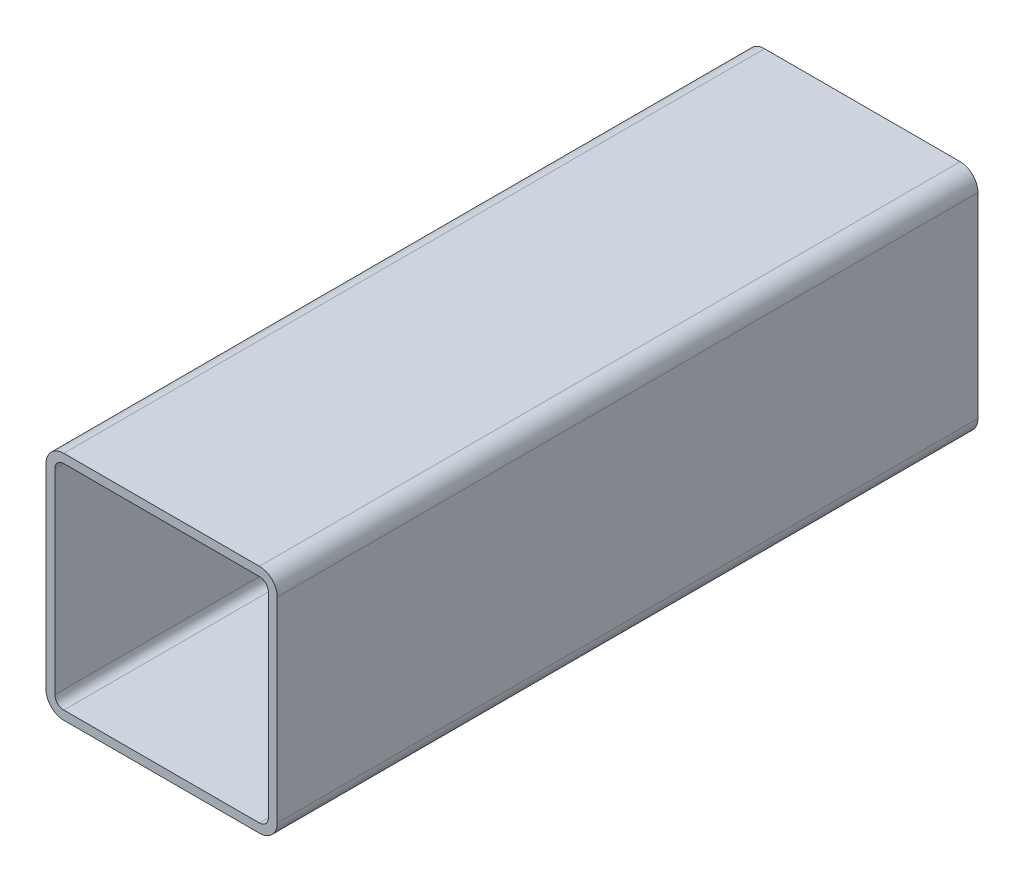
ISO-10303-21;
HEADER;
FILE_DESCRIPTION(('STEP AP214'),'2;1');
FILE_NAME('part.step','',(''),(''),'','','');
FILE_SCHEMA(('AUTOMOTIVE_DESIGN { 1 0 10303 214 1 1 1 1 }'));
ENDSEC;
DATA;
#1=APPLICATION_CONTEXT('core data for automotive mechanical design processes');
#2=APPLICATION_PROTOCOL_DEFINITION('international standard','automotive_design',2000,#1);
#3=PRODUCT_CONTEXT('',#1,'mechanical');
#4=PRODUCT('Part','Part','',(#3));
#5=PRODUCT_RELATED_PRODUCT_CATEGORY('part','',(#4));
#6=PRODUCT_DEFINITION_FORMATION('','',#4);
#7=PRODUCT_DEFINITION_CONTEXT('part definition',#1,'design');
#8=PRODUCT_DEFINITION('design','',#6,#7);
#9=PRODUCT_DEFINITION_SHAPE('','',#8);
#10=(LENGTH_UNIT() NAMED_UNIT(*) SI_UNIT(.MILLI.,.METRE.));
#11=(NAMED_UNIT(*) PLANE_ANGLE_UNIT() SI_UNIT($,.RADIAN.));
#12=(NAMED_UNIT(*) SI_UNIT($,.STERADIAN.) SOLID_ANGLE_UNIT());
#13=UNCERTAINTY_MEASURE_WITH_UNIT(LENGTH_MEASURE(1.E-05),#10,'distance_accuracy_value','');
#14=(GEOMETRIC_REPRESENTATION_CONTEXT(3) GLOBAL_UNCERTAINTY_ASSIGNED_CONTEXT((#13)) GLOBAL_UNIT_ASSIGNED_CONTEXT((#10,
#11,#12)) REPRESENTATION_CONTEXT('',''));
#15=CARTESIAN_POINT('',(0.,0.,0.));
#16=DIRECTION('',(0.,0.,1.));
#17=DIRECTION('',(1.,0.,0.));
#18=AXIS2_PLACEMENT_3D('',#15,#16,#17);
#19=CARTESIAN_POINT('',(-2.792,2.792,10.));
#20=DIRECTION('',(0.,0.,1.));
#21=DIRECTION('',(1.,0.,0.));
#22=AXIS2_PLACEMENT_3D('',#19,#20,#21);
#23=PLANE('',#22);
#24=CARTESIAN_POINT('',(-2.792,2.792,10.));
#25=DIRECTION('',(0.,0.,1.));
#26=DIRECTION('',(-1.,0.,0.));
#27=AXIS2_PLACEMENT_3D('',#24,#25,#26);
#28=CIRCLE('',#27,0.508);
#29=CARTESIAN_POINT('',(-2.792,3.3,10.));
#30=VERTEX_POINT('',#29);
#31=CARTESIAN_POINT('',(-3.3,2.792,10.));
#32=VERTEX_POINT('',#31);
#33=EDGE_CURVE('E259',#30,#32,#28,.T.);
#34=ORIENTED_EDGE('',*,*,#33,.T.);
#35=DIRECTION('',(0.,-1.,0.));
#36=VECTOR('',#35,1.);
#37=CARTESIAN_POINT('',(-3.3,-2.792,10.));
#38=LINE('',#37,#36);
#39=CARTESIAN_POINT('',(-3.3,-2.792,10.));
#40=VERTEX_POINT('',#39);
#41=EDGE_CURVE('E262',#32,#40,#38,.T.);
#42=ORIENTED_EDGE('',*,*,#41,.T.);
#43=CARTESIAN_POINT('',(-2.792,-2.792,10.));
#44=DIRECTION('',(0.,0.,1.));
#45=DIRECTION('',(-1.,0.,0.));
#46=AXIS2_PLACEMENT_3D('',#43,#44,#45);
#47=CIRCLE('',#46,0.508);
#48=CARTESIAN_POINT('',(-2.792,-3.3,10.));
#49=VERTEX_POINT('',#48);
#50=EDGE_CURVE('E265',#40,#49,#47,.T.);
#51=ORIENTED_EDGE('',*,*,#50,.T.);
#52=DIRECTION('',(1.,0.,0.));
#53=VECTOR('',#52,1.);
#54=CARTESIAN_POINT('',(-2.792,-3.3,10.));
#55=LINE('',#54,#53);
#56=CARTESIAN_POINT('',(2.792,-3.3,10.));
#57=VERTEX_POINT('',#56);
#58=EDGE_CURVE('E267',#49,#57,#55,.T.);
#59=ORIENTED_EDGE('',*,*,#58,.T.);
#60=CARTESIAN_POINT('',(2.792,-2.792,10.));
#61=DIRECTION('',(0.,0.,1.));
#62=DIRECTION('',(1.,0.,0.));
#63=AXIS2_PLACEMENT_3D('',#60,#61,#62);
#64=CIRCLE('',#63,0.508);
#65=CARTESIAN_POINT('',(3.3,-2.792,10.));
#66=VERTEX_POINT('',#65);
#67=EDGE_CURVE('E269',#57,#66,#64,.T.);
#68=ORIENTED_EDGE('',*,*,#67,.T.);
#69=DIRECTION('',(0.,1.,0.));
#70=VECTOR('',#69,1.);
#71=CARTESIAN_POINT('',(3.3,-2.792,10.));
#72=LINE('',#71,#70);
#73=CARTESIAN_POINT('',(3.3,2.792,10.));
#74=VERTEX_POINT('',#73);
#75=EDGE_CURVE('E271',#66,#74,#72,.T.);
#76=ORIENTED_EDGE('',*,*,#75,.T.);
#77=CARTESIAN_POINT('',(2.792,2.792,10.));
#78=DIRECTION('',(0.,0.,1.));
#79=DIRECTION('',(-1.,0.,0.));
#80=AXIS2_PLACEMENT_3D('',#77,#78,#79);
#81=CIRCLE('',#80,0.508);
#82=CARTESIAN_POINT('',(2.792,3.3,10.));
#83=VERTEX_POINT('',#82);
#84=EDGE_CURVE('E273',#74,#83,#81,.T.);
#85=ORIENTED_EDGE('',*,*,#84,.T.);
#86=DIRECTION('',(-1.,0.,0.));
#87=VECTOR('',#86,1.);
#88=CARTESIAN_POINT('',(-2.792,3.3,10.));
#89=LINE('',#88,#87);
#90=EDGE_CURVE('E275',#83,#30,#89,.T.);
#91=ORIENTED_EDGE('',*,*,#90,.T.);
#92=EDGE_LOOP('',(#34,#42,#51,#59,#68,#76,#85,#91));
#93=FACE_BOUND('',#92,.T.);
#94=DIRECTION('',(0.,-1.,0.));
#95=VECTOR('',#94,1.);
#96=CARTESIAN_POINT('',(-3.046,2.792,10.));
#97=LINE('',#96,#95);
#98=CARTESIAN_POINT('',(-3.046,2.792,10.));
#99=VERTEX_POINT('',#98);
#100=CARTESIAN_POINT('',(-3.046,-2.792,10.));
#101=VERTEX_POINT('',#100);
#102=EDGE_CURVE('E202',#99,#101,#97,.T.);
#103=ORIENTED_EDGE('',*,*,#102,.F.);
#104=CARTESIAN_POINT('',(-2.792,2.792,10.));
#105=DIRECTION('',(0.,0.,-1.));
#106=DIRECTION('',(-1.,0.,0.));
#107=AXIS2_PLACEMENT_3D('',#104,#105,#106);
#108=CIRCLE('',#107,0.254);
#109=CARTESIAN_POINT('',(-2.792,3.046,10.));
#110=VERTEX_POINT('',#109);
#111=EDGE_CURVE('E194',#110,#99,#108,.F.);
#112=ORIENTED_EDGE('',*,*,#111,.F.);
#113=DIRECTION('',(-1.,0.,0.));
#114=VECTOR('',#113,1.);
#115=CARTESIAN_POINT('',(-2.792,3.046,10.));
#116=LINE('',#115,#114);
#117=CARTESIAN_POINT('',(2.792,3.046,10.));
#118=VERTEX_POINT('',#117);
#119=EDGE_CURVE('E227',#118,#110,#116,.T.);
#120=ORIENTED_EDGE('',*,*,#119,.F.);
#121=CARTESIAN_POINT('',(2.792,2.792,10.));
#122=DIRECTION('',(0.,0.,-1.));
#123=DIRECTION('',(-1.,0.,0.));
#124=AXIS2_PLACEMENT_3D('',#121,#122,#123);
#125=CIRCLE('',#124,0.254);
#126=CARTESIAN_POINT('',(3.046,2.792,10.));
#127=VERTEX_POINT('',#126);
#128=EDGE_CURVE('E225',#127,#118,#125,.F.);
#129=ORIENTED_EDGE('',*,*,#128,.F.);
#130=DIRECTION('',(0.,1.,0.));
#131=VECTOR('',#130,1.);
#132=CARTESIAN_POINT('',(3.046,2.792,10.));
#133=LINE('',#132,#131);
#134=CARTESIAN_POINT('',(3.046,-2.792,10.));
#135=VERTEX_POINT('',#134);
#136=EDGE_CURVE('E223',#135,#127,#133,.T.);
#137=ORIENTED_EDGE('',*,*,#136,.F.);
#138=CARTESIAN_POINT('',(2.792,-2.792,10.));
#139=DIRECTION('',(0.,0.,-1.));
#140=DIRECTION('',(-1.,0.,0.));
#141=AXIS2_PLACEMENT_3D('',#138,#139,#140);
#142=CIRCLE('',#141,0.254);
#143=CARTESIAN_POINT('',(2.792,-3.046,10.));
#144=VERTEX_POINT('',#143);
#145=EDGE_CURVE('E221',#144,#135,#142,.F.);
#146=ORIENTED_EDGE('',*,*,#145,.F.);
#147=DIRECTION('',(1.,0.,0.));
#148=VECTOR('',#147,1.);
#149=CARTESIAN_POINT('',(-2.792,-3.046,10.));
#150=LINE('',#149,#148);
#151=CARTESIAN_POINT('',(-2.792,-3.046,10.));
#152=VERTEX_POINT('',#151);
#153=EDGE_CURVE('E217',#152,#144,#150,.T.);
#154=ORIENTED_EDGE('',*,*,#153,.F.);
#155=CARTESIAN_POINT('',(-2.792,-2.792,10.));
#156=DIRECTION('',(0.,0.,-1.));
#157=DIRECTION('',(-1.,0.,0.));
#158=AXIS2_PLACEMENT_3D('',#155,#156,#157);
#159=CIRCLE('',#158,0.254);
#160=EDGE_CURVE('E215',#101,#152,#159,.F.);
#161=ORIENTED_EDGE('',*,*,#160,.F.);
#162=EDGE_LOOP('',(#103,#112,#120,#129,#137,#146,#154,#161));
#163=FACE_BOUND('',#162,.T.);
#164=ADVANCED_FACE('F81',(#93,#163),#23,.T.);
#165=CARTESIAN_POINT('',(-2.792,2.792,-10.));
#166=DIRECTION('',(0.,0.,1.));
#167=DIRECTION('',(1.,0.,0.));
#168=AXIS2_PLACEMENT_3D('',#165,#166,#167);
#169=PLANE('',#168);
#170=CARTESIAN_POINT('',(-2.792,2.792,-10.));
#171=DIRECTION('',(0.,0.,1.));
#172=DIRECTION('',(-1.,0.,0.));
#173=AXIS2_PLACEMENT_3D('',#170,#171,#172);
#174=CIRCLE('',#173,0.508);
#175=CARTESIAN_POINT('',(-2.792,3.3,-10.));
#176=VERTEX_POINT('',#175);
#177=CARTESIAN_POINT('',(-3.3,2.792,-10.));
#178=VERTEX_POINT('',#177);
#179=EDGE_CURVE('E210',#176,#178,#174,.T.);
#180=ORIENTED_EDGE('',*,*,#179,.F.);
#181=DIRECTION('',(-1.,0.,0.));
#182=VECTOR('',#181,1.);
#183=CARTESIAN_POINT('',(-2.792,3.3,-10.));
#184=LINE('',#183,#182);
#185=CARTESIAN_POINT('',(2.792,3.3,-10.));
#186=VERTEX_POINT('',#185);
#187=EDGE_CURVE('E263',#186,#176,#184,.T.);
#188=ORIENTED_EDGE('',*,*,#187,.F.);
#189=CARTESIAN_POINT('',(2.792,2.792,-10.));
#190=DIRECTION('',(0.,0.,1.));
#191=DIRECTION('',(-1.,0.,0.));
#192=AXIS2_PLACEMENT_3D('',#189,#190,#191);
#193=CIRCLE('',#192,0.508);
#194=CARTESIAN_POINT('',(3.3,2.792,-10.));
#195=VERTEX_POINT('',#194);
#196=EDGE_CURVE('E290',#195,#186,#193,.T.);
#197=ORIENTED_EDGE('',*,*,#196,.F.);
#198=DIRECTION('',(0.,1.,0.));
#199=VECTOR('',#198,1.);
#200=CARTESIAN_POINT('',(3.3,-2.792,-10.));
#201=LINE('',#200,#199);
#202=CARTESIAN_POINT('',(3.3,-2.792,-10.));
#203=VERTEX_POINT('',#202);
#204=EDGE_CURVE('E288',#203,#195,#201,.T.);
#205=ORIENTED_EDGE('',*,*,#204,.F.);
#206=CARTESIAN_POINT('',(2.792,-2.792,-10.));
#207=DIRECTION('',(0.,0.,1.));
#208=DIRECTION('',(1.,0.,0.));
#209=AXIS2_PLACEMENT_3D('',#206,#207,#208);
#210=CIRCLE('',#209,0.508);
#211=CARTESIAN_POINT('',(2.792,-3.3,-10.));
#212=VERTEX_POINT('',#211);
#213=EDGE_CURVE('E286',#212,#203,#210,.T.);
#214=ORIENTED_EDGE('',*,*,#213,.F.);
#215=DIRECTION('',(1.,0.,0.));
#216=VECTOR('',#215,1.);
#217=CARTESIAN_POINT('',(-2.792,-3.3,-10.));
#218=LINE('',#217,#216);
#219=CARTESIAN_POINT('',(-2.792,-3.3,-10.));
#220=VERTEX_POINT('',#219);
#221=EDGE_CURVE('E284',#220,#212,#218,.T.);
#222=ORIENTED_EDGE('',*,*,#221,.F.);
#223=CARTESIAN_POINT('',(-2.792,-2.792,-10.));
#224=DIRECTION('',(0.,0.,1.));
#225=DIRECTION('',(-1.,0.,0.));
#226=AXIS2_PLACEMENT_3D('',#223,#224,#225);
#227=CIRCLE('',#226,0.508);
#228=CARTESIAN_POINT('',(-3.3,-2.792,-10.));
#229=VERTEX_POINT('',#228);
#230=EDGE_CURVE('E282',#229,#220,#227,.T.);
#231=ORIENTED_EDGE('',*,*,#230,.F.);
#232=DIRECTION('',(0.,-1.,0.));
#233=VECTOR('',#232,1.);
#234=CARTESIAN_POINT('',(-3.3,-2.792,-10.));
#235=LINE('',#234,#233);
#236=EDGE_CURVE('E280',#178,#229,#235,.T.);
#237=ORIENTED_EDGE('',*,*,#236,.F.);
#238=EDGE_LOOP('',(#180,#188,#197,#205,#214,#222,#231,#237));
#239=FACE_BOUND('',#238,.T.);
#240=CARTESIAN_POINT('',(-2.792,2.792,-10.));
#241=DIRECTION('',(0.,0.,-1.));
#242=DIRECTION('',(-1.,0.,0.));
#243=AXIS2_PLACEMENT_3D('',#240,#241,#242);
#244=CIRCLE('',#243,0.254);
#245=CARTESIAN_POINT('',(-2.792,3.046,-10.));
#246=VERTEX_POINT('',#245);
#247=CARTESIAN_POINT('',(-3.046,2.792,-10.));
#248=VERTEX_POINT('',#247);
#249=EDGE_CURVE('E104',#246,#248,#244,.F.);
#250=ORIENTED_EDGE('',*,*,#249,.T.);
#251=DIRECTION('',(0.,-1.,0.));
#252=VECTOR('',#251,1.);
#253=CARTESIAN_POINT('',(-3.046,2.792,-10.));
#254=LINE('',#253,#252);
#255=CARTESIAN_POINT('',(-3.046,-2.792,-10.));
#256=VERTEX_POINT('',#255);
#257=EDGE_CURVE('E209',#248,#256,#254,.T.);
#258=ORIENTED_EDGE('',*,*,#257,.T.);
#259=CARTESIAN_POINT('',(-2.792,-2.792,-10.));
#260=DIRECTION('',(0.,0.,-1.));
#261=DIRECTION('',(-1.,0.,0.));
#262=AXIS2_PLACEMENT_3D('',#259,#260,#261);
#263=CIRCLE('',#262,0.254);
#264=CARTESIAN_POINT('',(-2.792,-3.046,-10.));
#265=VERTEX_POINT('',#264);
#266=EDGE_CURVE('E231',#256,#265,#263,.F.);
#267=ORIENTED_EDGE('',*,*,#266,.T.);
#268=DIRECTION('',(1.,0.,0.));
#269=VECTOR('',#268,1.);
#270=CARTESIAN_POINT('',(-2.792,-3.046,-10.));
#271=LINE('',#270,#269);
#272=CARTESIAN_POINT('',(2.792,-3.046,-10.));
#273=VERTEX_POINT('',#272);
#274=EDGE_CURVE('E234',#265,#273,#271,.T.);
#275=ORIENTED_EDGE('',*,*,#274,.T.);
#276=CARTESIAN_POINT('',(2.792,-2.792,-10.));
#277=DIRECTION('',(0.,0.,-1.));
#278=DIRECTION('',(-1.,0.,0.));
#279=AXIS2_PLACEMENT_3D('',#276,#277,#278);
#280=CIRCLE('',#279,0.254);
#281=CARTESIAN_POINT('',(3.046,-2.792,-10.));
#282=VERTEX_POINT('',#281);
#283=EDGE_CURVE('E237',#273,#282,#280,.F.);
#284=ORIENTED_EDGE('',*,*,#283,.T.);
#285=DIRECTION('',(0.,1.,0.));
#286=VECTOR('',#285,1.);
#287=CARTESIAN_POINT('',(3.046,2.792,-10.));
#288=LINE('',#287,#286);
#289=CARTESIAN_POINT('',(3.046,2.792,-10.));
#290=VERTEX_POINT('',#289);
#291=EDGE_CURVE('E240',#282,#290,#288,.T.);
#292=ORIENTED_EDGE('',*,*,#291,.T.);
#293=CARTESIAN_POINT('',(2.792,2.792,-10.));
#294=DIRECTION('',(0.,0.,-1.));
#295=DIRECTION('',(-1.,0.,0.));
#296=AXIS2_PLACEMENT_3D('',#293,#294,#295);
#297=CIRCLE('',#296,0.254);
#298=CARTESIAN_POINT('',(2.792,3.046,-10.));
#299=VERTEX_POINT('',#298);
#300=EDGE_CURVE('E243',#290,#299,#297,.F.);
#301=ORIENTED_EDGE('',*,*,#300,.T.);
#302=DIRECTION('',(-1.,0.,0.));
#303=VECTOR('',#302,1.);
#304=CARTESIAN_POINT('',(-2.792,3.046,-10.));
#305=LINE('',#304,#303);
#306=EDGE_CURVE('E203',#299,#246,#305,.T.);
#307=ORIENTED_EDGE('',*,*,#306,.T.);
#308=EDGE_LOOP('',(#250,#258,#267,#275,#284,#292,#301,#307));
#309=FACE_BOUND('',#308,.T.);
#310=ADVANCED_FACE('F320',(#239,#309),#169,.F.);
#311=CARTESIAN_POINT('',(-2.792,2.792,10.));
#312=DIRECTION('',(0.,0.,-1.));
#313=DIRECTION('',(-1.,0.,0.));
#314=AXIS2_PLACEMENT_3D('',#311,#312,#313);
#315=CYLINDRICAL_SURFACE('',#314,0.508);
#316=ORIENTED_EDGE('',*,*,#179,.T.);
#317=DIRECTION('',(0.,0.,-1.));
#318=VECTOR('',#317,1.);
#319=CARTESIAN_POINT('',(-3.3,2.792,10.));
#320=LINE('',#319,#318);
#321=EDGE_CURVE('E12',#32,#178,#320,.T.);
#322=ORIENTED_EDGE('',*,*,#321,.F.);
#323=ORIENTED_EDGE('',*,*,#33,.F.);
#324=DIRECTION('',(0.,0.,-1.));
#325=VECTOR('',#324,1.);
#326=CARTESIAN_POINT('',(-2.792,3.3,10.));
#327=LINE('',#326,#325);
#328=EDGE_CURVE('E277',#30,#176,#327,.T.);
#329=ORIENTED_EDGE('',*,*,#328,.T.);
#330=EDGE_LOOP('',(#316,#322,#323,#329));
#331=FACE_BOUND('',#330,.T.);
#332=ADVANCED_FACE('F83',(#331),#315,.T.);
#333=CARTESIAN_POINT('',(-3.3,-2.792,10.));
#334=DIRECTION('',(1.,0.,0.));
#335=DIRECTION('',(0.,0.,-1.));
#336=AXIS2_PLACEMENT_3D('',#333,#334,#335);
#337=PLANE('',#336);
#338=ORIENTED_EDGE('',*,*,#236,.T.);
#339=DIRECTION('',(0.,0.,-1.));
#340=VECTOR('',#339,1.);
#341=CARTESIAN_POINT('',(-3.3,-2.792,10.));
#342=LINE('',#341,#340);
#343=EDGE_CURVE('E89',#40,#229,#342,.T.);
#344=ORIENTED_EDGE('',*,*,#343,.F.);
#345=ORIENTED_EDGE('',*,*,#41,.F.);
#346=ORIENTED_EDGE('',*,*,#321,.T.);
#347=EDGE_LOOP('',(#338,#344,#345,#346));
#348=FACE_BOUND('',#347,.T.);
#349=ADVANCED_FACE('F337',(#348),#337,.F.);
#350=CARTESIAN_POINT('',(-2.792,-2.792,10.));
#351=DIRECTION('',(0.,0.,-1.));
#352=DIRECTION('',(-1.,0.,0.));
#353=AXIS2_PLACEMENT_3D('',#350,#351,#352);
#354=CYLINDRICAL_SURFACE('',#353,0.508);
#355=ORIENTED_EDGE('',*,*,#230,.T.);
#356=DIRECTION('',(0.,0.,-1.));
#357=VECTOR('',#356,1.);
#358=CARTESIAN_POINT('',(-2.792,-3.3,10.));
#359=LINE('',#358,#357);
#360=EDGE_CURVE('E307',#49,#220,#359,.T.);
#361=ORIENTED_EDGE('',*,*,#360,.F.);
#362=ORIENTED_EDGE('',*,*,#50,.F.);
#363=ORIENTED_EDGE('',*,*,#343,.T.);
#364=EDGE_LOOP('',(#355,#361,#362,#363));
#365=FACE_BOUND('',#364,.T.);
#366=ADVANCED_FACE('F314',(#365),#354,.T.);
#367=CARTESIAN_POINT('',(-2.792,-3.3,10.));
#368=DIRECTION('',(0.,1.,0.));
#369=DIRECTION('',(0.,0.,1.));
#370=AXIS2_PLACEMENT_3D('',#367,#368,#369);
#371=PLANE('',#370);
#372=ORIENTED_EDGE('',*,*,#221,.T.);
#373=DIRECTION('',(0.,0.,-1.));
#374=VECTOR('',#373,1.);
#375=CARTESIAN_POINT('',(2.792,-3.3,10.));
#376=LINE('',#375,#374);
#377=EDGE_CURVE('E304',#57,#212,#376,.T.);
#378=ORIENTED_EDGE('',*,*,#377,.F.);
#379=ORIENTED_EDGE('',*,*,#58,.F.);
#380=ORIENTED_EDGE('',*,*,#360,.T.);
#381=EDGE_LOOP('',(#372,#378,#379,#380));
#382=FACE_BOUND('',#381,.T.);
#383=ADVANCED_FACE('F326',(#382),#371,.F.);
#384=CARTESIAN_POINT('',(2.792,-2.792,10.));
#385=DIRECTION('',(0.,0.,-1.));
#386=DIRECTION('',(-1.,0.,0.));
#387=AXIS2_PLACEMENT_3D('',#384,#385,#386);
#388=CYLINDRICAL_SURFACE('',#387,0.508);
#389=ORIENTED_EDGE('',*,*,#213,.T.);
#390=DIRECTION('',(0.,0.,-1.));
#391=VECTOR('',#390,1.);
#392=CARTESIAN_POINT('',(3.3,-2.792,10.));
#393=LINE('',#392,#391);
#394=EDGE_CURVE('E301',#66,#203,#393,.T.);
#395=ORIENTED_EDGE('',*,*,#394,.F.);
#396=ORIENTED_EDGE('',*,*,#67,.F.);
#397=ORIENTED_EDGE('',*,*,#377,.T.);
#398=EDGE_LOOP('',(#389,#395,#396,#397));
#399=FACE_BOUND('',#398,.T.);
#400=ADVANCED_FACE('F330',(#399),#388,.T.);
#401=CARTESIAN_POINT('',(3.3,-2.792,10.));
#402=DIRECTION('',(-1.,0.,0.));
#403=DIRECTION('',(0.,0.,1.));
#404=AXIS2_PLACEMENT_3D('',#401,#402,#403);
#405=PLANE('',#404);
#406=ORIENTED_EDGE('',*,*,#204,.T.);
#407=DIRECTION('',(0.,0.,-1.));
#408=VECTOR('',#407,1.);
#409=CARTESIAN_POINT('',(3.3,2.792,10.));
#410=LINE('',#409,#408);
#411=EDGE_CURVE('E298',#74,#195,#410,.T.);
#412=ORIENTED_EDGE('',*,*,#411,.F.);
#413=ORIENTED_EDGE('',*,*,#75,.F.);
#414=ORIENTED_EDGE('',*,*,#394,.T.);
#415=EDGE_LOOP('',(#406,#412,#413,#414));
#416=FACE_BOUND('',#415,.T.);
#417=ADVANCED_FACE('F350',(#416),#405,.F.);
#418=CARTESIAN_POINT('',(2.792,2.792,10.));
#419=DIRECTION('',(0.,0.,-1.));
#420=DIRECTION('',(-1.,0.,0.));
#421=AXIS2_PLACEMENT_3D('',#418,#419,#420);
#422=CYLINDRICAL_SURFACE('',#421,0.508);
#423=ORIENTED_EDGE('',*,*,#196,.T.);
#424=DIRECTION('',(0.,0.,-1.));
#425=VECTOR('',#424,1.);
#426=CARTESIAN_POINT('',(2.792,3.3,10.));
#427=LINE('',#426,#425);
#428=EDGE_CURVE('E295',#83,#186,#427,.T.);
#429=ORIENTED_EDGE('',*,*,#428,.F.);
#430=ORIENTED_EDGE('',*,*,#84,.F.);
#431=ORIENTED_EDGE('',*,*,#411,.T.);
#432=EDGE_LOOP('',(#423,#429,#430,#431));
#433=FACE_BOUND('',#432,.T.);
#434=ADVANCED_FACE('F348',(#433),#422,.T.);
#435=CARTESIAN_POINT('',(-2.792,3.3,10.));
#436=DIRECTION('',(0.,-1.,0.));
#437=DIRECTION('',(0.,0.,-1.));
#438=AXIS2_PLACEMENT_3D('',#435,#436,#437);
#439=PLANE('',#438);
#440=ORIENTED_EDGE('',*,*,#187,.T.);
#441=ORIENTED_EDGE('',*,*,#328,.F.);
#442=ORIENTED_EDGE('',*,*,#90,.F.);
#443=ORIENTED_EDGE('',*,*,#428,.T.);
#444=EDGE_LOOP('',(#440,#441,#442,#443));
#445=FACE_BOUND('',#444,.T.);
#446=ADVANCED_FACE('F343',(#445),#439,.F.);
#447=CARTESIAN_POINT('',(-2.792,2.792,10.));
#448=DIRECTION('',(0.,0.,-1.));
#449=DIRECTION('',(-1.,0.,0.));
#450=AXIS2_PLACEMENT_3D('',#447,#448,#449);
#451=CYLINDRICAL_SURFACE('',#450,0.254);
#452=ORIENTED_EDGE('',*,*,#249,.F.);
#453=DIRECTION('',(0.,0.,-1.));
#454=VECTOR('',#453,1.);
#455=CARTESIAN_POINT('',(-2.792,3.046,10.));
#456=LINE('',#455,#454);
#457=EDGE_CURVE('E198',#110,#246,#456,.T.);
#458=ORIENTED_EDGE('',*,*,#457,.F.);
#459=ORIENTED_EDGE('',*,*,#111,.T.);
#460=DIRECTION('',(0.,0.,-1.));
#461=VECTOR('',#460,1.);
#462=CARTESIAN_POINT('',(-3.046,2.792,10.));
#463=LINE('',#462,#461);
#464=EDGE_CURVE('E197',#99,#248,#463,.T.);
#465=ORIENTED_EDGE('',*,*,#464,.T.);
#466=EDGE_LOOP('',(#452,#458,#459,#465));
#467=FACE_BOUND('',#466,.T.);
#468=ADVANCED_FACE('F196',(#467),#451,.F.);
#469=CARTESIAN_POINT('',(-3.046,2.792,10.));
#470=DIRECTION('',(1.,0.,0.));
#471=DIRECTION('',(0.,0.,-1.));
#472=AXIS2_PLACEMENT_3D('',#469,#470,#471);
#473=PLANE('',#472);
#474=ORIENTED_EDGE('',*,*,#257,.F.);
#475=ORIENTED_EDGE('',*,*,#464,.F.);
#476=ORIENTED_EDGE('',*,*,#102,.T.);
#477=DIRECTION('',(0.,0.,-1.));
#478=VECTOR('',#477,1.);
#479=CARTESIAN_POINT('',(-3.046,-2.792,10.));
#480=LINE('',#479,#478);
#481=EDGE_CURVE('E211',#101,#256,#480,.T.);
#482=ORIENTED_EDGE('',*,*,#481,.T.);
#483=EDGE_LOOP('',(#474,#475,#476,#482));
#484=FACE_BOUND('',#483,.T.);
#485=ADVANCED_FACE('F206',(#484),#473,.T.);
#486=CARTESIAN_POINT('',(-2.792,-2.792,10.));
#487=DIRECTION('',(0.,0.,-1.));
#488=DIRECTION('',(-1.,0.,0.));
#489=AXIS2_PLACEMENT_3D('',#486,#487,#488);
#490=CYLINDRICAL_SURFACE('',#489,0.254);
#491=ORIENTED_EDGE('',*,*,#266,.F.);
#492=ORIENTED_EDGE('',*,*,#481,.F.);
#493=ORIENTED_EDGE('',*,*,#160,.T.);
#494=DIRECTION('',(0.,0.,-1.));
#495=VECTOR('',#494,1.);
#496=CARTESIAN_POINT('',(-2.792,-3.046,10.));
#497=LINE('',#496,#495);
#498=EDGE_CURVE('E256',#152,#265,#497,.T.);
#499=ORIENTED_EDGE('',*,*,#498,.T.);
#500=EDGE_LOOP('',(#491,#492,#493,#499));
#501=FACE_BOUND('',#500,.T.);
#502=ADVANCED_FACE('F375',(#501),#490,.F.);
#503=CARTESIAN_POINT('',(-2.792,-3.046,10.));
#504=DIRECTION('',(0.,1.,0.));
#505=DIRECTION('',(0.,0.,1.));
#506=AXIS2_PLACEMENT_3D('',#503,#504,#505);
#507=PLANE('',#506);
#508=ORIENTED_EDGE('',*,*,#274,.F.);
#509=ORIENTED_EDGE('',*,*,#498,.F.);
#510=ORIENTED_EDGE('',*,*,#153,.T.);
#511=DIRECTION('',(0.,0.,-1.));
#512=VECTOR('',#511,1.);
#513=CARTESIAN_POINT('',(2.792,-3.046,10.));
#514=LINE('',#513,#512);
#515=EDGE_CURVE('E254',#144,#273,#514,.T.);
#516=ORIENTED_EDGE('',*,*,#515,.T.);
#517=EDGE_LOOP('',(#508,#509,#510,#516));
#518=FACE_BOUND('',#517,.T.);
#519=ADVANCED_FACE('F379',(#518),#507,.T.);
#520=CARTESIAN_POINT('',(2.792,-2.792,10.));
#521=DIRECTION('',(0.,0.,-1.));
#522=DIRECTION('',(-1.,0.,0.));
#523=AXIS2_PLACEMENT_3D('',#520,#521,#522);
#524=CYLINDRICAL_SURFACE('',#523,0.254);
#525=ORIENTED_EDGE('',*,*,#283,.F.);
#526=ORIENTED_EDGE('',*,*,#515,.F.);
#527=ORIENTED_EDGE('',*,*,#145,.T.);
#528=DIRECTION('',(0.,0.,-1.));
#529=VECTOR('',#528,1.);
#530=CARTESIAN_POINT('',(3.046,-2.792,10.));
#531=LINE('',#530,#529);
#532=EDGE_CURVE('E252',#135,#282,#531,.T.);
#533=ORIENTED_EDGE('',*,*,#532,.T.);
#534=EDGE_LOOP('',(#525,#526,#527,#533));
#535=FACE_BOUND('',#534,.T.);
#536=ADVANCED_FACE('F385',(#535),#524,.F.);
#537=CARTESIAN_POINT('',(3.046,2.792,10.));
#538=DIRECTION('',(-1.,0.,0.));
#539=DIRECTION('',(0.,0.,1.));
#540=AXIS2_PLACEMENT_3D('',#537,#538,#539);
#541=PLANE('',#540);
#542=ORIENTED_EDGE('',*,*,#291,.F.);
#543=ORIENTED_EDGE('',*,*,#532,.F.);
#544=ORIENTED_EDGE('',*,*,#136,.T.);
#545=DIRECTION('',(0.,0.,-1.));
#546=VECTOR('',#545,1.);
#547=CARTESIAN_POINT('',(3.046,2.792,10.));
#548=LINE('',#547,#546);
#549=EDGE_CURVE('E250',#127,#290,#548,.T.);
#550=ORIENTED_EDGE('',*,*,#549,.T.);
#551=EDGE_LOOP('',(#542,#543,#544,#550));
#552=FACE_BOUND('',#551,.T.);
#553=ADVANCED_FACE('F389',(#552),#541,.T.);
#554=CARTESIAN_POINT('',(2.792,2.792,10.));
#555=DIRECTION('',(0.,0.,-1.));
#556=DIRECTION('',(-1.,0.,0.));
#557=AXIS2_PLACEMENT_3D('',#554,#555,#556);
#558=CYLINDRICAL_SURFACE('',#557,0.254);
#559=ORIENTED_EDGE('',*,*,#300,.F.);
#560=ORIENTED_EDGE('',*,*,#549,.F.);
#561=ORIENTED_EDGE('',*,*,#128,.T.);
#562=DIRECTION('',(0.,0.,-1.));
#563=VECTOR('',#562,1.);
#564=CARTESIAN_POINT('',(2.792,3.046,10.));
#565=LINE('',#564,#563);
#566=EDGE_CURVE('E96',#118,#299,#565,.T.);
#567=ORIENTED_EDGE('',*,*,#566,.T.);
#568=EDGE_LOOP('',(#559,#560,#561,#567));
#569=FACE_BOUND('',#568,.T.);
#570=ADVANCED_FACE('F393',(#569),#558,.F.);
#571=CARTESIAN_POINT('',(-2.792,3.046,10.));
#572=DIRECTION('',(0.,-1.,0.));
#573=DIRECTION('',(0.,0.,-1.));
#574=AXIS2_PLACEMENT_3D('',#571,#572,#573);
#575=PLANE('',#574);
#576=ORIENTED_EDGE('',*,*,#306,.F.);
#577=ORIENTED_EDGE('',*,*,#566,.F.);
#578=ORIENTED_EDGE('',*,*,#119,.T.);
#579=ORIENTED_EDGE('',*,*,#457,.T.);
#580=EDGE_LOOP('',(#576,#577,#578,#579));
#581=FACE_BOUND('',#580,.T.);
#582=ADVANCED_FACE('F397',(#581),#575,.T.);
#583=CLOSED_SHELL('',(#164,#310,#332,#349,#366,#383,#400,#417,#434,#446,#468,#485,#502,#519,
#536,#553,#570,#582));
#584=MANIFOLD_SOLID_BREP('B2',#583);
#585=ADVANCED_BREP_SHAPE_REPRESENTATION('',(#18,#584),#14);
#586=SHAPE_DEFINITION_REPRESENTATION(#9,#585);
ENDSEC;
END-ISO-10303-21;
